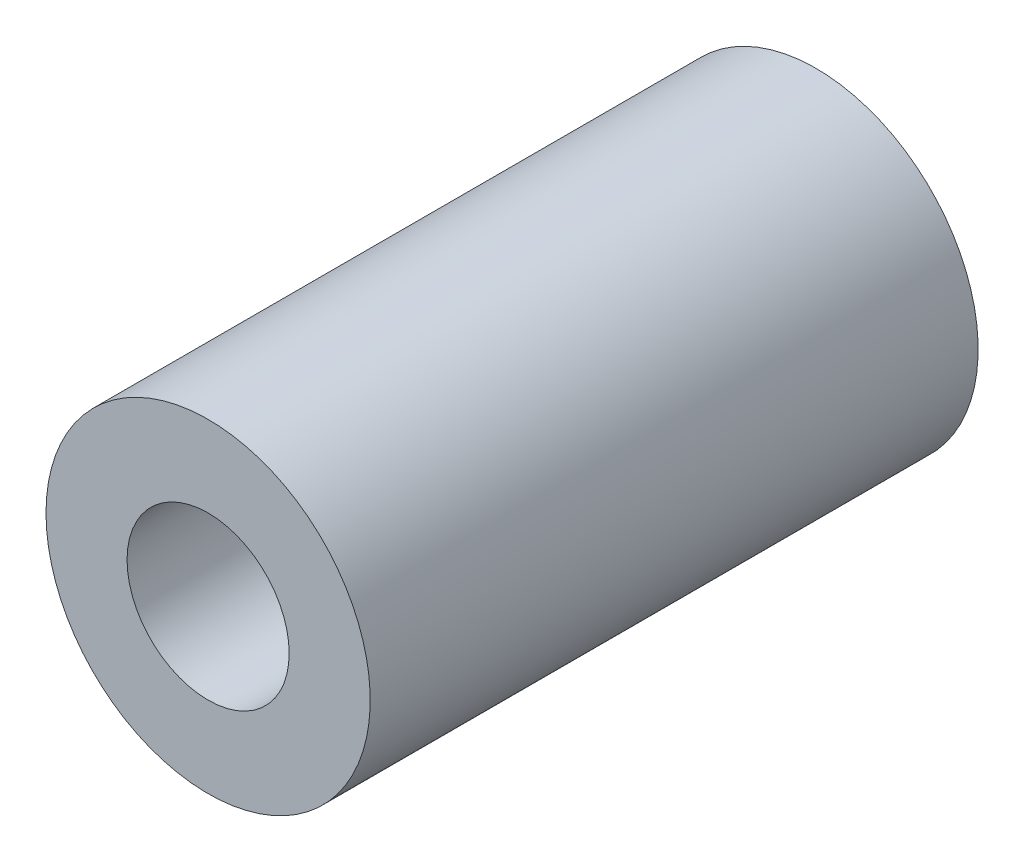
ISO-10303-21;
HEADER;
FILE_DESCRIPTION(('STEP AP214'),'2;1');
FILE_NAME('part.step','',(''),(''),'','','');
FILE_SCHEMA(('AUTOMOTIVE_DESIGN { 1 0 10303 214 1 1 1 1 }'));
ENDSEC;
DATA;
#1=APPLICATION_CONTEXT('core data for automotive mechanical design processes');
#2=APPLICATION_PROTOCOL_DEFINITION('international standard','automotive_design',2000,#1);
#3=PRODUCT_CONTEXT('',#1,'mechanical');
#4=PRODUCT('Part','Part','',(#3));
#5=PRODUCT_RELATED_PRODUCT_CATEGORY('part','',(#4));
#6=PRODUCT_DEFINITION_FORMATION('','',#4);
#7=PRODUCT_DEFINITION_CONTEXT('part definition',#1,'design');
#8=PRODUCT_DEFINITION('design','',#6,#7);
#9=PRODUCT_DEFINITION_SHAPE('','',#8);
#10=(LENGTH_UNIT() NAMED_UNIT(*) SI_UNIT(.MILLI.,.METRE.));
#11=(NAMED_UNIT(*) PLANE_ANGLE_UNIT() SI_UNIT($,.RADIAN.));
#12=(NAMED_UNIT(*) SI_UNIT($,.STERADIAN.) SOLID_ANGLE_UNIT());
#13=UNCERTAINTY_MEASURE_WITH_UNIT(LENGTH_MEASURE(1.E-05),#10,'distance_accuracy_value','');
#14=(GEOMETRIC_REPRESENTATION_CONTEXT(3) GLOBAL_UNCERTAINTY_ASSIGNED_CONTEXT((#13)) GLOBAL_UNIT_ASSIGNED_CONTEXT((#10,
#11,#12)) REPRESENTATION_CONTEXT('',''));
#15=CARTESIAN_POINT('',(0.,0.,0.));
#16=DIRECTION('',(0.,0.,1.));
#17=DIRECTION('',(1.,0.,0.));
#18=AXIS2_PLACEMENT_3D('',#15,#16,#17);
#19=CARTESIAN_POINT('',(110.164644693159,149.062971337462,229.393433153119));
#20=DIRECTION('',(0.,0.,1.));
#21=DIRECTION('',(1.,0.,0.));
#22=AXIS2_PLACEMENT_3D('',#19,#20,#21);
#23=CYLINDRICAL_SURFACE('',#22,4.00000000000001);
#24=CARTESIAN_POINT('',(110.164644693159,149.062971337462,255.707141652104));
#25=DIRECTION('',(0.,0.,-1.));
#26=DIRECTION('',(-1.,0.,0.));
#27=AXIS2_PLACEMENT_3D('',#24,#25,#26);
#28=CIRCLE('',#27,4.00000000000001);
#29=CARTESIAN_POINT('',(106.164644693159,149.062971337462,255.707141652104));
#30=VERTEX_POINT('',#29);
#31=EDGE_CURVE('E38',#30,#30,#28,.T.);
#32=ORIENTED_EDGE('',*,*,#31,.T.);
#33=EDGE_LOOP('',(#32));
#34=FACE_BOUND('',#33,.T.);
#35=CARTESIAN_POINT('',(110.164644693159,149.062971337462,240.707141652104));
#36=DIRECTION('',(0.,0.,-1.));
#37=DIRECTION('',(-1.,0.,0.));
#38=AXIS2_PLACEMENT_3D('',#35,#36,#37);
#39=CIRCLE('',#38,4.00000000000001);
#40=CARTESIAN_POINT('',(106.164644693159,149.062971337462,240.707141652104));
#41=VERTEX_POINT('',#40);
#42=EDGE_CURVE('E10',#41,#41,#39,.T.);
#43=ORIENTED_EDGE('',*,*,#42,.F.);
#44=EDGE_LOOP('',(#43));
#45=FACE_BOUND('',#44,.T.);
#46=ADVANCED_FACE('F31',(#34,#45),#23,.T.);
#47=CARTESIAN_POINT('',(110.164644693159,149.062971337462,255.707141652104));
#48=DIRECTION('',(0.,0.,-1.));
#49=DIRECTION('',(-1.,0.,0.));
#50=AXIS2_PLACEMENT_3D('',#47,#48,#49);
#51=PLANE('',#50);
#52=ORIENTED_EDGE('',*,*,#31,.F.);
#53=EDGE_LOOP('',(#52));
#54=FACE_BOUND('',#53,.T.);
#55=CARTESIAN_POINT('',(110.164644693159,149.062971337462,255.707141652104));
#56=DIRECTION('',(0.,0.,-1.));
#57=DIRECTION('',(-1.,0.,0.));
#58=AXIS2_PLACEMENT_3D('',#55,#56,#57);
#59=CIRCLE('',#58,2.00000381000798);
#60=CARTESIAN_POINT('',(108.164640883151,149.062971337462,255.707141652104));
#61=VERTEX_POINT('',#60);
#62=EDGE_CURVE('E43',#61,#61,#59,.T.);
#63=ORIENTED_EDGE('',*,*,#62,.T.);
#64=EDGE_LOOP('',(#63));
#65=FACE_BOUND('',#64,.T.);
#66=ADVANCED_FACE('F59',(#54,#65),#51,.F.);
#67=CARTESIAN_POINT('',(110.164644693159,149.062971337462,229.393433153119));
#68=DIRECTION('',(0.,0.,1.));
#69=DIRECTION('',(1.,0.,0.));
#70=AXIS2_PLACEMENT_3D('',#67,#68,#69);
#71=CYLINDRICAL_SURFACE('',#70,2.00000381000798);
#72=ORIENTED_EDGE('',*,*,#62,.F.);
#73=EDGE_LOOP('',(#72));
#74=FACE_BOUND('',#73,.T.);
#75=CARTESIAN_POINT('',(110.164644693159,149.062971337462,240.707141652104));
#76=DIRECTION('',(0.,0.,-1.));
#77=DIRECTION('',(-1.,0.,0.));
#78=AXIS2_PLACEMENT_3D('',#75,#76,#77);
#79=CIRCLE('',#78,2.00000381000798);
#80=CARTESIAN_POINT('',(108.164640883151,149.062971337462,240.707141652104));
#81=VERTEX_POINT('',#80);
#82=EDGE_CURVE('E34',#81,#81,#79,.T.);
#83=ORIENTED_EDGE('',*,*,#82,.T.);
#84=EDGE_LOOP('',(#83));
#85=FACE_BOUND('',#84,.T.);
#86=ADVANCED_FACE('F51',(#74,#85),#71,.F.);
#87=CARTESIAN_POINT('',(64.6677213013123,196.635356467922,240.707141652104));
#88=DIRECTION('',(0.,0.,-1.));
#89=DIRECTION('',(0.,-1.,0.));
#90=AXIS2_PLACEMENT_3D('',#87,#88,#89);
#91=PLANE('',#90);
#92=ORIENTED_EDGE('',*,*,#82,.F.);
#93=EDGE_LOOP('',(#92));
#94=FACE_BOUND('',#93,.T.);
#95=ORIENTED_EDGE('',*,*,#42,.T.);
#96=EDGE_LOOP('',(#95));
#97=FACE_BOUND('',#96,.T.);
#98=ADVANCED_FACE('F53',(#94,#97),#91,.T.);
#99=CLOSED_SHELL('',(#46,#66,#86,#98));
#100=MANIFOLD_SOLID_BREP('B2',#99);
#101=ADVANCED_BREP_SHAPE_REPRESENTATION('',(#18,#100),#14);
#102=SHAPE_DEFINITION_REPRESENTATION(#9,#101);
ENDSEC;
END-ISO-10303-21;
